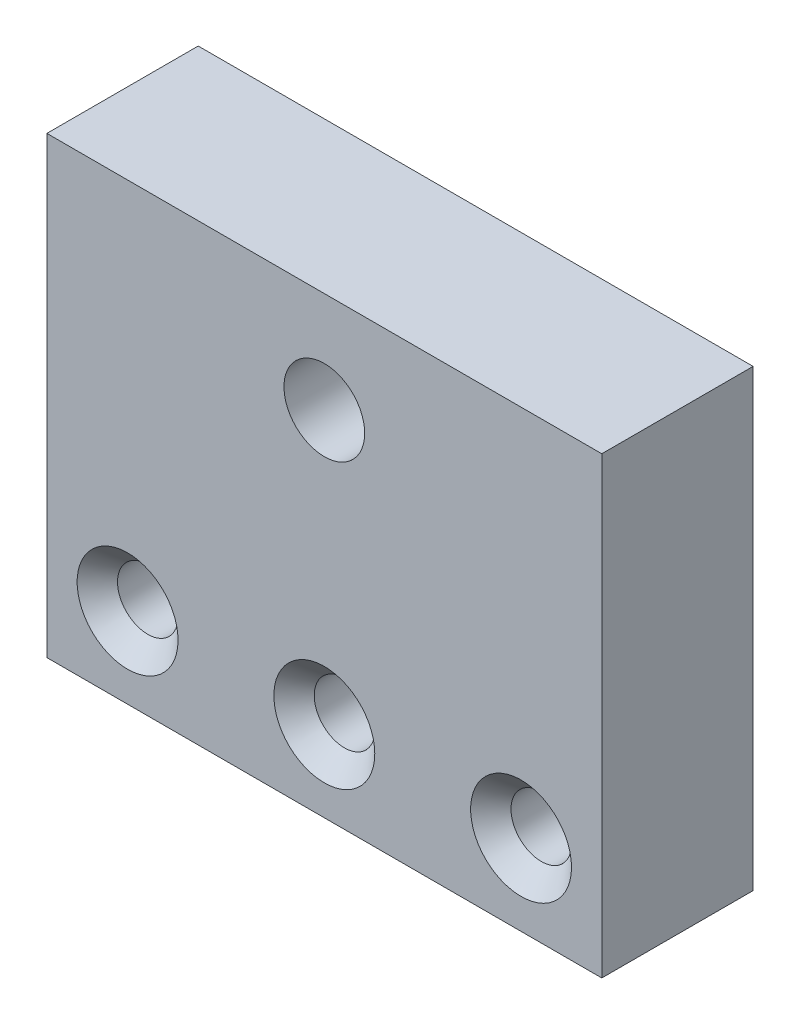
ISO-10303-21;
HEADER;
FILE_DESCRIPTION(('STEP AP214'),'2;1');
FILE_NAME('part.step','',(''),(''),'','','');
FILE_SCHEMA(('AUTOMOTIVE_DESIGN { 1 0 10303 214 1 1 1 1 }'));
ENDSEC;
DATA;
#1=APPLICATION_CONTEXT('core data for automotive mechanical design processes');
#2=APPLICATION_PROTOCOL_DEFINITION('international standard','automotive_design',2000,#1);
#3=PRODUCT_CONTEXT('',#1,'mechanical');
#4=PRODUCT('Part','Part','',(#3));
#5=PRODUCT_RELATED_PRODUCT_CATEGORY('part','',(#4));
#6=PRODUCT_DEFINITION_FORMATION('','',#4);
#7=PRODUCT_DEFINITION_CONTEXT('part definition',#1,'design');
#8=PRODUCT_DEFINITION('design','',#6,#7);
#9=PRODUCT_DEFINITION_SHAPE('','',#8);
#10=(LENGTH_UNIT() NAMED_UNIT(*) SI_UNIT(.MILLI.,.METRE.));
#11=(NAMED_UNIT(*) PLANE_ANGLE_UNIT() SI_UNIT($,.RADIAN.));
#12=(NAMED_UNIT(*) SI_UNIT($,.STERADIAN.) SOLID_ANGLE_UNIT());
#13=UNCERTAINTY_MEASURE_WITH_UNIT(LENGTH_MEASURE(1.E-05),#10,'distance_accuracy_value','');
#14=(GEOMETRIC_REPRESENTATION_CONTEXT(3) GLOBAL_UNCERTAINTY_ASSIGNED_CONTEXT((#13)) GLOBAL_UNIT_ASSIGNED_CONTEXT((#10,
#11,#12)) REPRESENTATION_CONTEXT('',''));
#15=CARTESIAN_POINT('',(0.,0.,0.));
#16=DIRECTION('',(0.,0.,1.));
#17=DIRECTION('',(1.,0.,0.));
#18=AXIS2_PLACEMENT_3D('',#15,#16,#17);
#19=CARTESIAN_POINT('',(0.,0.,7.5));
#20=DIRECTION('',(0.,0.,-1.));
#21=DIRECTION('',(-1.,0.,0.));
#22=AXIS2_PLACEMENT_3D('',#19,#20,#21);
#23=PLANE('',#22);
#24=CARTESIAN_POINT('',(27.5,35.,7.5));
#25=DIRECTION('',(0.,0.,1.));
#26=DIRECTION('',(1.,0.,0.));
#27=AXIS2_PLACEMENT_3D('',#24,#25,#26);
#28=CIRCLE('',#27,3.99999999999999);
#29=CARTESIAN_POINT('',(31.5,35.,7.5));
#30=VERTEX_POINT('',#29);
#31=EDGE_CURVE('E141',#30,#30,#28,.T.);
#32=ORIENTED_EDGE('',*,*,#31,.F.);
#33=EDGE_LOOP('',(#32));
#34=FACE_BOUND('',#33,.T.);
#35=CARTESIAN_POINT('',(27.5,8.,7.5));
#36=DIRECTION('',(0.,0.,1.));
#37=DIRECTION('',(1.,0.,0.));
#38=AXIS2_PLACEMENT_3D('',#35,#36,#37);
#39=CIRCLE('',#38,5.);
#40=CARTESIAN_POINT('',(32.5,8.,7.5));
#41=VERTEX_POINT('',#40);
#42=EDGE_CURVE('E126',#41,#41,#39,.T.);
#43=ORIENTED_EDGE('',*,*,#42,.F.);
#44=EDGE_LOOP('',(#43));
#45=FACE_BOUND('',#44,.T.);
#46=CARTESIAN_POINT('',(47.,8.,7.5));
#47=DIRECTION('',(0.,0.,1.));
#48=DIRECTION('',(1.,0.,0.));
#49=AXIS2_PLACEMENT_3D('',#46,#47,#48);
#50=CIRCLE('',#49,5.);
#51=CARTESIAN_POINT('',(52.,8.,7.5));
#52=VERTEX_POINT('',#51);
#53=EDGE_CURVE('E117',#52,#52,#50,.T.);
#54=ORIENTED_EDGE('',*,*,#53,.F.);
#55=EDGE_LOOP('',(#54));
#56=FACE_BOUND('',#55,.T.);
#57=DIRECTION('',(0.,-1.,0.));
#58=VECTOR('',#57,1.);
#59=CARTESIAN_POINT('',(0.,0.,7.5));
#60=LINE('',#59,#58);
#61=CARTESIAN_POINT('',(0.,45.,7.5));
#62=VERTEX_POINT('',#61);
#63=CARTESIAN_POINT('',(0.,0.,7.5));
#64=VERTEX_POINT('',#63);
#65=EDGE_CURVE('E86',#62,#64,#60,.T.);
#66=ORIENTED_EDGE('',*,*,#65,.T.);
#67=DIRECTION('',(1.,0.,0.));
#68=VECTOR('',#67,1.);
#69=CARTESIAN_POINT('',(0.,0.,7.5));
#70=LINE('',#69,#68);
#71=CARTESIAN_POINT('',(55.,0.,7.5));
#72=VERTEX_POINT('',#71);
#73=EDGE_CURVE('E81',#64,#72,#70,.T.);
#74=ORIENTED_EDGE('',*,*,#73,.T.);
#75=DIRECTION('',(0.,1.,0.));
#76=VECTOR('',#75,1.);
#77=CARTESIAN_POINT('',(55.,0.,7.5));
#78=LINE('',#77,#76);
#79=CARTESIAN_POINT('',(55.,45.,7.5));
#80=VERTEX_POINT('',#79);
#81=EDGE_CURVE('E84',#72,#80,#78,.T.);
#82=ORIENTED_EDGE('',*,*,#81,.T.);
#83=DIRECTION('',(-1.,0.,0.));
#84=VECTOR('',#83,1.);
#85=CARTESIAN_POINT('',(0.,45.,7.5));
#86=LINE('',#85,#84);
#87=EDGE_CURVE('E51',#80,#62,#86,.T.);
#88=ORIENTED_EDGE('',*,*,#87,.T.);
#89=EDGE_LOOP('',(#66,#74,#82,#88));
#90=FACE_BOUND('',#89,.T.);
#91=CARTESIAN_POINT('',(8.,8.,7.5));
#92=DIRECTION('',(0.,0.,1.));
#93=DIRECTION('',(1.,0.,0.));
#94=AXIS2_PLACEMENT_3D('',#91,#92,#93);
#95=CIRCLE('',#94,5.);
#96=CARTESIAN_POINT('',(13.,8.,7.5));
#97=VERTEX_POINT('',#96);
#98=EDGE_CURVE('E135',#97,#97,#95,.T.);
#99=ORIENTED_EDGE('',*,*,#98,.F.);
#100=EDGE_LOOP('',(#99));
#101=FACE_BOUND('',#100,.T.);
#102=ADVANCED_FACE('F34',(#34,#45,#56,#90,#101),#23,.F.);
#103=CARTESIAN_POINT('',(0.,0.,7.5));
#104=DIRECTION('',(1.,0.,0.));
#105=DIRECTION('',(0.,0.,-1.));
#106=AXIS2_PLACEMENT_3D('',#103,#104,#105);
#107=PLANE('',#106);
#108=DIRECTION('',(0.,-1.,0.));
#109=VECTOR('',#108,1.);
#110=CARTESIAN_POINT('',(0.,0.,-7.5));
#111=LINE('',#110,#109);
#112=CARTESIAN_POINT('',(0.,45.,-7.5));
#113=VERTEX_POINT('',#112);
#114=CARTESIAN_POINT('',(0.,0.,-7.5));
#115=VERTEX_POINT('',#114);
#116=EDGE_CURVE('E98',#113,#115,#111,.T.);
#117=ORIENTED_EDGE('',*,*,#116,.T.);
#118=DIRECTION('',(0.,0.,-1.));
#119=VECTOR('',#118,1.);
#120=CARTESIAN_POINT('',(0.,0.,7.5));
#121=LINE('',#120,#119);
#122=EDGE_CURVE('E11',#64,#115,#121,.T.);
#123=ORIENTED_EDGE('',*,*,#122,.F.);
#124=ORIENTED_EDGE('',*,*,#65,.F.);
#125=DIRECTION('',(0.,0.,-1.));
#126=VECTOR('',#125,1.);
#127=CARTESIAN_POINT('',(0.,45.,7.5));
#128=LINE('',#127,#126);
#129=EDGE_CURVE('E94',#62,#113,#128,.T.);
#130=ORIENTED_EDGE('',*,*,#129,.T.);
#131=EDGE_LOOP('',(#117,#123,#124,#130));
#132=FACE_BOUND('',#131,.T.);
#133=ADVANCED_FACE('F36',(#132),#107,.F.);
#134=CARTESIAN_POINT('',(0.,0.,7.5));
#135=DIRECTION('',(0.,1.,0.));
#136=DIRECTION('',(0.,0.,1.));
#137=AXIS2_PLACEMENT_3D('',#134,#135,#136);
#138=PLANE('',#137);
#139=DIRECTION('',(1.,0.,0.));
#140=VECTOR('',#139,1.);
#141=CARTESIAN_POINT('',(0.,0.,-7.5));
#142=LINE('',#141,#140);
#143=CARTESIAN_POINT('',(55.,0.,-7.5));
#144=VERTEX_POINT('',#143);
#145=EDGE_CURVE('E90',#115,#144,#142,.T.);
#146=ORIENTED_EDGE('',*,*,#145,.T.);
#147=DIRECTION('',(0.,0.,-1.));
#148=VECTOR('',#147,1.);
#149=CARTESIAN_POINT('',(55.,0.,7.5));
#150=LINE('',#149,#148);
#151=EDGE_CURVE('E43',#72,#144,#150,.T.);
#152=ORIENTED_EDGE('',*,*,#151,.F.);
#153=ORIENTED_EDGE('',*,*,#73,.F.);
#154=ORIENTED_EDGE('',*,*,#122,.T.);
#155=EDGE_LOOP('',(#146,#152,#153,#154));
#156=FACE_BOUND('',#155,.T.);
#157=ADVANCED_FACE('F89',(#156),#138,.F.);
#158=CARTESIAN_POINT('',(55.,0.,7.5));
#159=DIRECTION('',(-1.,0.,0.));
#160=DIRECTION('',(0.,0.,1.));
#161=AXIS2_PLACEMENT_3D('',#158,#159,#160);
#162=PLANE('',#161);
#163=DIRECTION('',(0.,1.,0.));
#164=VECTOR('',#163,1.);
#165=CARTESIAN_POINT('',(55.,0.,-7.5));
#166=LINE('',#165,#164);
#167=CARTESIAN_POINT('',(55.,45.,-7.5));
#168=VERTEX_POINT('',#167);
#169=EDGE_CURVE('E68',#144,#168,#166,.T.);
#170=ORIENTED_EDGE('',*,*,#169,.T.);
#171=DIRECTION('',(0.,0.,-1.));
#172=VECTOR('',#171,1.);
#173=CARTESIAN_POINT('',(55.,45.,7.5));
#174=LINE('',#173,#172);
#175=EDGE_CURVE('E91',#80,#168,#174,.T.);
#176=ORIENTED_EDGE('',*,*,#175,.F.);
#177=ORIENTED_EDGE('',*,*,#81,.F.);
#178=ORIENTED_EDGE('',*,*,#151,.T.);
#179=EDGE_LOOP('',(#170,#176,#177,#178));
#180=FACE_BOUND('',#179,.T.);
#181=ADVANCED_FACE('F92',(#180),#162,.F.);
#182=CARTESIAN_POINT('',(0.,45.,7.5));
#183=DIRECTION('',(0.,-1.,0.));
#184=DIRECTION('',(0.,0.,-1.));
#185=AXIS2_PLACEMENT_3D('',#182,#183,#184);
#186=PLANE('',#185);
#187=DIRECTION('',(-1.,0.,0.));
#188=VECTOR('',#187,1.);
#189=CARTESIAN_POINT('',(0.,45.,-7.5));
#190=LINE('',#189,#188);
#191=EDGE_CURVE('E74',#168,#113,#190,.T.);
#192=ORIENTED_EDGE('',*,*,#191,.T.);
#193=ORIENTED_EDGE('',*,*,#129,.F.);
#194=ORIENTED_EDGE('',*,*,#87,.F.);
#195=ORIENTED_EDGE('',*,*,#175,.T.);
#196=EDGE_LOOP('',(#192,#193,#194,#195));
#197=FACE_BOUND('',#196,.T.);
#198=ADVANCED_FACE('F106',(#197),#186,.F.);
#199=CARTESIAN_POINT('',(0.,0.,-7.5));
#200=DIRECTION('',(0.,0.,-1.));
#201=DIRECTION('',(-1.,0.,0.));
#202=AXIS2_PLACEMENT_3D('',#199,#200,#201);
#203=PLANE('',#202);
#204=CARTESIAN_POINT('',(27.5,35.,-7.50000000000001));
#205=DIRECTION('',(0.,0.,1.));
#206=DIRECTION('',(1.,0.,0.));
#207=AXIS2_PLACEMENT_3D('',#204,#205,#206);
#208=CIRCLE('',#207,4.);
#209=CARTESIAN_POINT('',(31.5,35.,-7.50000000000001));
#210=VERTEX_POINT('',#209);
#211=EDGE_CURVE('E138',#210,#210,#208,.T.);
#212=ORIENTED_EDGE('',*,*,#211,.T.);
#213=EDGE_LOOP('',(#212));
#214=FACE_BOUND('',#213,.T.);
#215=CARTESIAN_POINT('',(8.,8.,-7.50000000000001));
#216=DIRECTION('',(0.,0.,1.));
#217=DIRECTION('',(1.,0.,0.));
#218=AXIS2_PLACEMENT_3D('',#215,#216,#217);
#219=CIRCLE('',#218,2.99999999999996);
#220=CARTESIAN_POINT('',(11.,8.,-7.50000000000001));
#221=VERTEX_POINT('',#220);
#222=EDGE_CURVE('E129',#221,#221,#219,.T.);
#223=ORIENTED_EDGE('',*,*,#222,.T.);
#224=EDGE_LOOP('',(#223));
#225=FACE_BOUND('',#224,.T.);
#226=CARTESIAN_POINT('',(27.5,8.,-7.50000000000001));
#227=DIRECTION('',(0.,0.,1.));
#228=DIRECTION('',(1.,0.,0.));
#229=AXIS2_PLACEMENT_3D('',#226,#227,#228);
#230=CIRCLE('',#229,2.99999999999996);
#231=CARTESIAN_POINT('',(30.5,8.,-7.50000000000001));
#232=VERTEX_POINT('',#231);
#233=EDGE_CURVE('E120',#232,#232,#230,.T.);
#234=ORIENTED_EDGE('',*,*,#233,.T.);
#235=EDGE_LOOP('',(#234));
#236=FACE_BOUND('',#235,.T.);
#237=CARTESIAN_POINT('',(47.,8.,-7.50000000000001));
#238=DIRECTION('',(0.,0.,1.));
#239=DIRECTION('',(1.,0.,0.));
#240=AXIS2_PLACEMENT_3D('',#237,#238,#239);
#241=CIRCLE('',#240,2.99999999999996);
#242=CARTESIAN_POINT('',(50.,8.,-7.50000000000001));
#243=VERTEX_POINT('',#242);
#244=EDGE_CURVE('E101',#243,#243,#241,.T.);
#245=ORIENTED_EDGE('',*,*,#244,.T.);
#246=EDGE_LOOP('',(#245));
#247=FACE_BOUND('',#246,.T.);
#248=ORIENTED_EDGE('',*,*,#116,.F.);
#249=ORIENTED_EDGE('',*,*,#191,.F.);
#250=ORIENTED_EDGE('',*,*,#169,.F.);
#251=ORIENTED_EDGE('',*,*,#145,.F.);
#252=EDGE_LOOP('',(#248,#249,#250,#251));
#253=FACE_BOUND('',#252,.T.);
#254=ADVANCED_FACE('F109',(#214,#225,#236,#247,#253),#203,.T.);
#255=CARTESIAN_POINT('',(47.,8.,7.5));
#256=DIRECTION('',(0.,0.,1.));
#257=DIRECTION('',(1.,0.,0.));
#258=AXIS2_PLACEMENT_3D('',#255,#256,#257);
#259=CYLINDRICAL_SURFACE('',#258,2.99999999999996);
#260=ORIENTED_EDGE('',*,*,#244,.F.);
#261=EDGE_LOOP('',(#260));
#262=FACE_BOUND('',#261,.T.);
#263=CARTESIAN_POINT('',(47.,8.,5.5));
#264=DIRECTION('',(0.,0.,1.));
#265=DIRECTION('',(1.,0.,0.));
#266=AXIS2_PLACEMENT_3D('',#263,#264,#265);
#267=CIRCLE('',#266,2.99999999999997);
#268=CARTESIAN_POINT('',(50.,8.,5.5));
#269=VERTEX_POINT('',#268);
#270=EDGE_CURVE('E114',#269,#269,#267,.T.);
#271=ORIENTED_EDGE('',*,*,#270,.T.);
#272=EDGE_LOOP('',(#271));
#273=FACE_BOUND('',#272,.T.);
#274=ADVANCED_FACE('F157',(#262,#273),#259,.F.);
#275=CARTESIAN_POINT('',(47.,8.,7.5));
#276=DIRECTION('',(0.,0.,1.));
#277=DIRECTION('',(1.,0.,0.));
#278=AXIS2_PLACEMENT_3D('',#275,#276,#277);
#279=CONICAL_SURFACE('',#278,5.,0.785398163397455);
#280=ORIENTED_EDGE('',*,*,#270,.F.);
#281=EDGE_LOOP('',(#280));
#282=FACE_BOUND('',#281,.T.);
#283=ORIENTED_EDGE('',*,*,#53,.T.);
#284=EDGE_LOOP('',(#283));
#285=FACE_BOUND('',#284,.T.);
#286=ADVANCED_FACE('F154',(#282,#285),#279,.F.);
#287=CARTESIAN_POINT('',(27.5,8.,7.5));
#288=DIRECTION('',(0.,0.,1.));
#289=DIRECTION('',(1.,0.,0.));
#290=AXIS2_PLACEMENT_3D('',#287,#288,#289);
#291=CYLINDRICAL_SURFACE('',#290,2.99999999999996);
#292=ORIENTED_EDGE('',*,*,#233,.F.);
#293=EDGE_LOOP('',(#292));
#294=FACE_BOUND('',#293,.T.);
#295=CARTESIAN_POINT('',(27.5,8.,5.5));
#296=DIRECTION('',(0.,0.,1.));
#297=DIRECTION('',(1.,0.,0.));
#298=AXIS2_PLACEMENT_3D('',#295,#296,#297);
#299=CIRCLE('',#298,2.99999999999996);
#300=CARTESIAN_POINT('',(30.5,8.,5.5));
#301=VERTEX_POINT('',#300);
#302=EDGE_CURVE('E123',#301,#301,#299,.T.);
#303=ORIENTED_EDGE('',*,*,#302,.T.);
#304=EDGE_LOOP('',(#303));
#305=FACE_BOUND('',#304,.T.);
#306=ADVANCED_FACE('F156',(#294,#305),#291,.F.);
#307=CARTESIAN_POINT('',(27.5,8.,7.5));
#308=DIRECTION('',(0.,0.,1.));
#309=DIRECTION('',(1.,0.,0.));
#310=AXIS2_PLACEMENT_3D('',#307,#308,#309);
#311=CONICAL_SURFACE('',#310,5.,0.785398163397457);
#312=ORIENTED_EDGE('',*,*,#302,.F.);
#313=EDGE_LOOP('',(#312));
#314=FACE_BOUND('',#313,.T.);
#315=ORIENTED_EDGE('',*,*,#42,.T.);
#316=EDGE_LOOP('',(#315));
#317=FACE_BOUND('',#316,.T.);
#318=ADVANCED_FACE('F164',(#314,#317),#311,.F.);
#319=CARTESIAN_POINT('',(8.,8.,7.5));
#320=DIRECTION('',(0.,0.,1.));
#321=DIRECTION('',(1.,0.,0.));
#322=AXIS2_PLACEMENT_3D('',#319,#320,#321);
#323=CYLINDRICAL_SURFACE('',#322,2.99999999999997);
#324=ORIENTED_EDGE('',*,*,#222,.F.);
#325=EDGE_LOOP('',(#324));
#326=FACE_BOUND('',#325,.T.);
#327=CARTESIAN_POINT('',(8.,8.,5.5));
#328=DIRECTION('',(0.,0.,1.));
#329=DIRECTION('',(1.,0.,0.));
#330=AXIS2_PLACEMENT_3D('',#327,#328,#329);
#331=CIRCLE('',#330,2.99999999999997);
#332=CARTESIAN_POINT('',(11.,8.,5.5));
#333=VERTEX_POINT('',#332);
#334=EDGE_CURVE('E132',#333,#333,#331,.T.);
#335=ORIENTED_EDGE('',*,*,#334,.T.);
#336=EDGE_LOOP('',(#335));
#337=FACE_BOUND('',#336,.T.);
#338=ADVANCED_FACE('F217',(#326,#337),#323,.F.);
#339=CARTESIAN_POINT('',(8.,8.,7.5));
#340=DIRECTION('',(0.,0.,1.));
#341=DIRECTION('',(1.,0.,0.));
#342=AXIS2_PLACEMENT_3D('',#339,#340,#341);
#343=CONICAL_SURFACE('',#342,5.,0.785398163397456);
#344=ORIENTED_EDGE('',*,*,#334,.F.);
#345=EDGE_LOOP('',(#344));
#346=FACE_BOUND('',#345,.T.);
#347=ORIENTED_EDGE('',*,*,#98,.T.);
#348=EDGE_LOOP('',(#347));
#349=FACE_BOUND('',#348,.T.);
#350=ADVANCED_FACE('F196',(#346,#349),#343,.F.);
#351=CARTESIAN_POINT('',(27.5,35.,7.5));
#352=DIRECTION('',(0.,0.,1.));
#353=DIRECTION('',(1.,0.,0.));
#354=AXIS2_PLACEMENT_3D('',#351,#352,#353);
#355=CYLINDRICAL_SURFACE('',#354,3.99999999999999);
#356=ORIENTED_EDGE('',*,*,#211,.F.);
#357=EDGE_LOOP('',(#356));
#358=FACE_BOUND('',#357,.T.);
#359=ORIENTED_EDGE('',*,*,#31,.T.);
#360=EDGE_LOOP('',(#359));
#361=FACE_BOUND('',#360,.T.);
#362=ADVANCED_FACE('F145',(#358,#361),#355,.F.);
#363=CLOSED_SHELL('',(#102,#133,#157,#181,#198,#254,#274,#286,#306,#318,#338,#350,#362));
#364=MANIFOLD_SOLID_BREP('B2',#363);
#365=ADVANCED_BREP_SHAPE_REPRESENTATION('',(#18,#364),#14);
#366=SHAPE_DEFINITION_REPRESENTATION(#9,#365);
ENDSEC;
END-ISO-10303-21;
